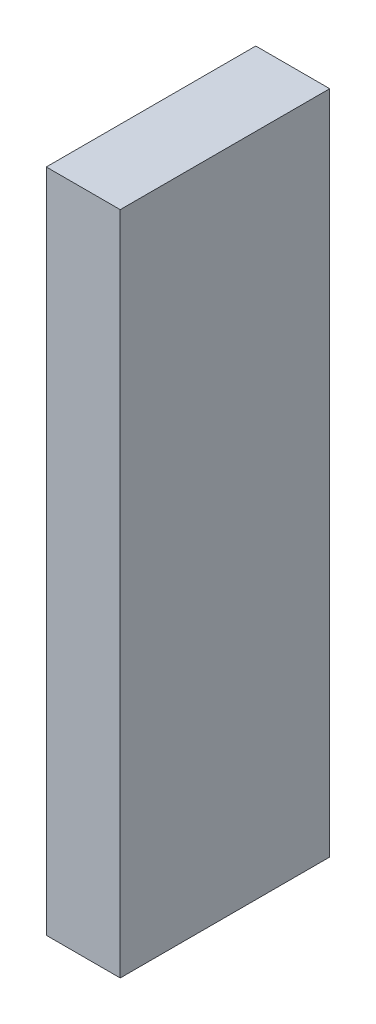
ISO-10303-21;
HEADER;
FILE_DESCRIPTION(('STEP AP214'),'2;1');
FILE_NAME('part.step','',(''),(''),'','','');
FILE_SCHEMA(('AUTOMOTIVE_DESIGN { 1 0 10303 214 1 1 1 1 }'));
ENDSEC;
DATA;
#1=APPLICATION_CONTEXT('core data for automotive mechanical design processes');
#2=APPLICATION_PROTOCOL_DEFINITION('international standard','automotive_design',2000,#1);
#3=PRODUCT_CONTEXT('',#1,'mechanical');
#4=PRODUCT('Part','Part','',(#3));
#5=PRODUCT_RELATED_PRODUCT_CATEGORY('part','',(#4));
#6=PRODUCT_DEFINITION_FORMATION('','',#4);
#7=PRODUCT_DEFINITION_CONTEXT('part definition',#1,'design');
#8=PRODUCT_DEFINITION('design','',#6,#7);
#9=PRODUCT_DEFINITION_SHAPE('','',#8);
#10=(LENGTH_UNIT() NAMED_UNIT(*) SI_UNIT(.MILLI.,.METRE.));
#11=(NAMED_UNIT(*) PLANE_ANGLE_UNIT() SI_UNIT($,.RADIAN.));
#12=(NAMED_UNIT(*) SI_UNIT($,.STERADIAN.) SOLID_ANGLE_UNIT());
#13=UNCERTAINTY_MEASURE_WITH_UNIT(LENGTH_MEASURE(1.E-05),#10,'distance_accuracy_value','');
#14=(GEOMETRIC_REPRESENTATION_CONTEXT(3) GLOBAL_UNCERTAINTY_ASSIGNED_CONTEXT((#13)) GLOBAL_UNIT_ASSIGNED_CONTEXT((#10,
#11,#12)) REPRESENTATION_CONTEXT('',''));
#15=CARTESIAN_POINT('',(0.,0.,0.));
#16=DIRECTION('',(0.,0.,1.));
#17=DIRECTION('',(1.,0.,0.));
#18=AXIS2_PLACEMENT_3D('',#15,#16,#17);
#19=CARTESIAN_POINT('',(-3.04999409833651,2.70000524247745,0.));
#20=DIRECTION('',(-1.,8.74227765734759E-08,0.));
#21=DIRECTION('',(-8.74227765734759E-08,-1.,0.));
#22=AXIS2_PLACEMENT_3D('',#19,#20,#21);
#23=PLANE('',#22);
#24=DIRECTION('',(-8.74227765512293E-08,-0.999999999999996,0.));
#25=VECTOR('',#24,1.);
#26=CARTESIAN_POINT('',(-3.04999409833651,2.70000524247745,0.));
#27=LINE('',#26,#25);
#28=CARTESIAN_POINT('',(-3.04999409833651,2.70000524247745,0.));
#29=VERTEX_POINT('',#28);
#30=CARTESIAN_POINT('',(-3.04999457041897,-2.69998865400693,0.));
#31=VERTEX_POINT('',#30);
#32=EDGE_CURVE('E11',#29,#31,#27,.T.);
#33=ORIENTED_EDGE('',*,*,#32,.T.);
#34=DIRECTION('',(0.,0.,1.));
#35=VECTOR('',#34,1.);
#36=CARTESIAN_POINT('',(-3.04999457041897,-2.69998865400693,0.));
#37=LINE('',#36,#35);
#38=CARTESIAN_POINT('',(-3.04999457041897,-2.69998865400693,1.6999990940094));
#39=VERTEX_POINT('',#38);
#40=EDGE_CURVE('E88',#31,#39,#37,.T.);
#41=ORIENTED_EDGE('',*,*,#40,.T.);
#42=DIRECTION('',(-8.74227765512293E-08,-0.999999999999996,0.));
#43=VECTOR('',#42,1.);
#44=CARTESIAN_POINT('',(-3.04999409833651,2.70000524247745,1.6999990940094));
#45=LINE('',#44,#43);
#46=CARTESIAN_POINT('',(-3.04999409833651,2.70000524247745,1.6999990940094));
#47=VERTEX_POINT('',#46);
#48=EDGE_CURVE('E83',#47,#39,#45,.T.);
#49=ORIENTED_EDGE('',*,*,#48,.F.);
#50=DIRECTION('',(0.,0.,1.));
#51=VECTOR('',#50,1.);
#52=CARTESIAN_POINT('',(-3.04999409833651,2.70000524247745,0.));
#53=LINE('',#52,#51);
#54=EDGE_CURVE('E72',#29,#47,#53,.T.);
#55=ORIENTED_EDGE('',*,*,#54,.F.);
#56=EDGE_LOOP('',(#33,#41,#49,#55));
#57=FACE_BOUND('',#56,.T.);
#58=ADVANCED_FACE('F17',(#57),#23,.T.);
#59=CARTESIAN_POINT('',(-3.04999457041897,-2.69998865400693,0.));
#60=DIRECTION('',(-8.74227765734759E-08,-1.,0.));
#61=DIRECTION('',(1.,-8.74227765734759E-08,0.));
#62=AXIS2_PLACEMENT_3D('',#59,#60,#61);
#63=PLANE('',#62);
#64=DIRECTION('',(0.999999999999996,-8.74227765779932E-08,0.));
#65=VECTOR('',#64,1.);
#66=CARTESIAN_POINT('',(-3.04999457041897,-2.69998865400693,0.));
#67=LINE('',#66,#65);
#68=CARTESIAN_POINT('',(-2.45001135508694,-2.69998870645912,0.));
#69=VERTEX_POINT('',#68);
#70=EDGE_CURVE('E24',#31,#69,#67,.T.);
#71=ORIENTED_EDGE('',*,*,#70,.T.);
#72=DIRECTION('',(0.,0.,1.));
#73=VECTOR('',#72,1.);
#74=CARTESIAN_POINT('',(-2.45001135508694,-2.69998870645913,0.));
#75=LINE('',#74,#73);
#76=CARTESIAN_POINT('',(-2.45001135508694,-2.69998870645912,1.6999990940094));
#77=VERTEX_POINT('',#76);
#78=EDGE_CURVE('E85',#69,#77,#75,.T.);
#79=ORIENTED_EDGE('',*,*,#78,.T.);
#80=DIRECTION('',(0.999999999999996,-8.74227765779932E-08,0.));
#81=VECTOR('',#80,1.);
#82=CARTESIAN_POINT('',(-3.04999457041897,-2.69998865400693,1.6999990940094));
#83=LINE('',#82,#81);
#84=EDGE_CURVE('E66',#39,#77,#83,.T.);
#85=ORIENTED_EDGE('',*,*,#84,.F.);
#86=ORIENTED_EDGE('',*,*,#40,.F.);
#87=EDGE_LOOP('',(#71,#79,#85,#86));
#88=FACE_BOUND('',#87,.T.);
#89=ADVANCED_FACE('F89',(#88),#63,.T.);
#90=CARTESIAN_POINT('',(-2.45001135508694,-2.69998870645912,0.));
#91=DIRECTION('',(1.,-8.74227765734759E-08,0.));
#92=DIRECTION('',(8.74227765734759E-08,1.,0.));
#93=AXIS2_PLACEMENT_3D('',#90,#91,#92);
#94=PLANE('',#93);
#95=DIRECTION('',(8.74227765512293E-08,0.999999999999996,0.));
#96=VECTOR('',#95,1.);
#97=CARTESIAN_POINT('',(-2.45001135508694,-2.69998870645912,0.));
#98=LINE('',#97,#96);
#99=CARTESIAN_POINT('',(-2.45001088300448,2.70000519002525,0.));
#100=VERTEX_POINT('',#99);
#101=EDGE_CURVE('E62',#69,#100,#98,.T.);
#102=ORIENTED_EDGE('',*,*,#101,.T.);
#103=DIRECTION('',(0.,0.,1.));
#104=VECTOR('',#103,1.);
#105=CARTESIAN_POINT('',(-2.45001088300448,2.70000519002525,0.));
#106=LINE('',#105,#104);
#107=CARTESIAN_POINT('',(-2.45001088300448,2.70000519002525,1.6999990940094));
#108=VERTEX_POINT('',#107);
#109=EDGE_CURVE('E55',#100,#108,#106,.T.);
#110=ORIENTED_EDGE('',*,*,#109,.T.);
#111=DIRECTION('',(8.74227765512293E-08,0.999999999999996,0.));
#112=VECTOR('',#111,1.);
#113=CARTESIAN_POINT('',(-2.45001135508694,-2.69998870645912,1.6999990940094));
#114=LINE('',#113,#112);
#115=EDGE_CURVE('E59',#77,#108,#114,.T.);
#116=ORIENTED_EDGE('',*,*,#115,.F.);
#117=ORIENTED_EDGE('',*,*,#78,.F.);
#118=EDGE_LOOP('',(#102,#110,#116,#117));
#119=FACE_BOUND('',#118,.T.);
#120=ADVANCED_FACE('F57',(#119),#94,.T.);
#121=CARTESIAN_POINT('',(-2.45001088300448,2.70000519002525,0.));
#122=DIRECTION('',(8.74227765734759E-08,1.,0.));
#123=DIRECTION('',(-1.,8.74227765734759E-08,0.));
#124=AXIS2_PLACEMENT_3D('',#121,#122,#123);
#125=PLANE('',#124);
#126=DIRECTION('',(-0.999999999999996,8.74227765779932E-08,0.));
#127=VECTOR('',#126,1.);
#128=CARTESIAN_POINT('',(-2.45001088300448,2.70000519002525,0.));
#129=LINE('',#128,#127);
#130=EDGE_CURVE('E65',#100,#29,#129,.T.);
#131=ORIENTED_EDGE('',*,*,#130,.T.);
#132=ORIENTED_EDGE('',*,*,#54,.T.);
#133=DIRECTION('',(-0.999999999999996,8.74227765779932E-08,0.));
#134=VECTOR('',#133,1.);
#135=CARTESIAN_POINT('',(-2.45001088300448,2.70000519002525,1.6999990940094));
#136=LINE('',#135,#134);
#137=EDGE_CURVE('E70',#108,#47,#136,.T.);
#138=ORIENTED_EDGE('',*,*,#137,.F.);
#139=ORIENTED_EDGE('',*,*,#109,.F.);
#140=EDGE_LOOP('',(#131,#132,#138,#139));
#141=FACE_BOUND('',#140,.T.);
#142=ADVANCED_FACE('F71',(#141),#125,.T.);
#143=CARTESIAN_POINT('',(91.8250045776367,74.8249969482422,1.6999990940094));
#144=DIRECTION('',(0.,0.,1.));
#145=DIRECTION('',(-1.,8.74227765734759E-08,0.));
#146=AXIS2_PLACEMENT_3D('',#143,#144,#145);
#147=PLANE('',#146);
#148=ORIENTED_EDGE('',*,*,#48,.T.);
#149=ORIENTED_EDGE('',*,*,#84,.T.);
#150=ORIENTED_EDGE('',*,*,#115,.T.);
#151=ORIENTED_EDGE('',*,*,#137,.T.);
#152=EDGE_LOOP('',(#148,#149,#150,#151));
#153=FACE_BOUND('',#152,.T.);
#154=ADVANCED_FACE('F76',(#153),#147,.T.);
#155=CARTESIAN_POINT('',(91.8250045776367,74.8249969482422,0.));
#156=DIRECTION('',(0.,0.,1.));
#157=DIRECTION('',(-1.,8.74227765734759E-08,0.));
#158=AXIS2_PLACEMENT_3D('',#155,#156,#157);
#159=PLANE('',#158);
#160=ORIENTED_EDGE('',*,*,#130,.F.);
#161=ORIENTED_EDGE('',*,*,#101,.F.);
#162=ORIENTED_EDGE('',*,*,#70,.F.);
#163=ORIENTED_EDGE('',*,*,#32,.F.);
#164=EDGE_LOOP('',(#160,#161,#162,#163));
#165=FACE_BOUND('',#164,.T.);
#166=ADVANCED_FACE('F91',(#165),#159,.F.);
#167=CLOSED_SHELL('',(#58,#89,#120,#142,#154,#166));
#168=MANIFOLD_SOLID_BREP('B1',#167);
#169=ADVANCED_BREP_SHAPE_REPRESENTATION('',(#18,#168),#14);
#170=SHAPE_DEFINITION_REPRESENTATION(#9,#169);
ENDSEC;
END-ISO-10303-21;
